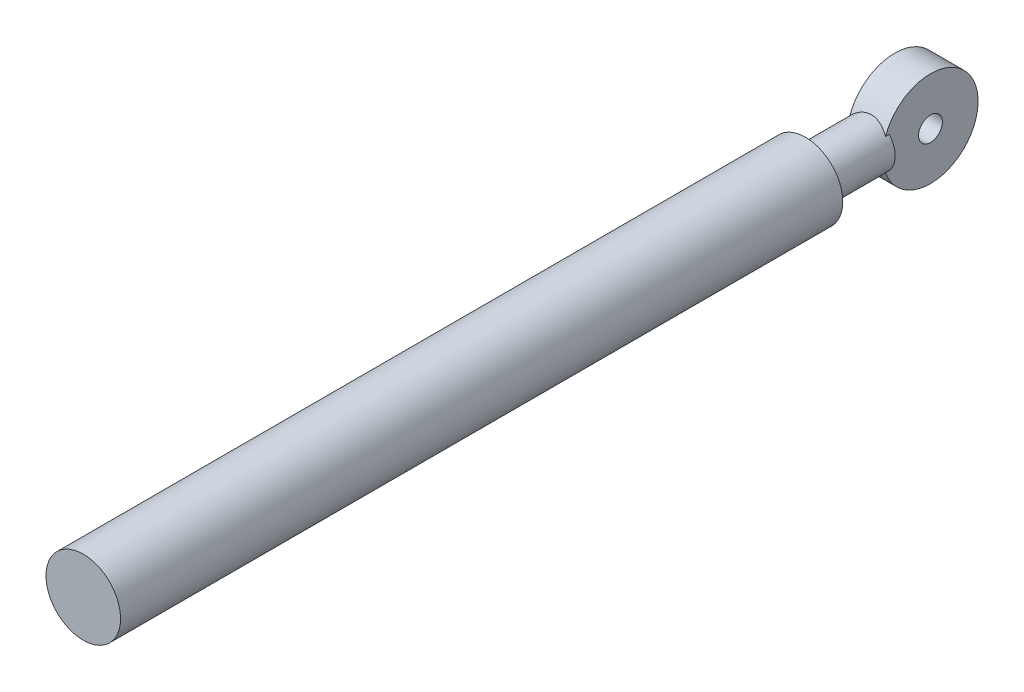
ISO-10303-21;
HEADER;
FILE_DESCRIPTION(('STEP AP214'),'2;1');
FILE_NAME('part.step','',(''),(''),'','','');
FILE_SCHEMA(('AUTOMOTIVE_DESIGN { 1 0 10303 214 1 1 1 1 }'));
ENDSEC;
DATA;
#1=APPLICATION_CONTEXT('core data for automotive mechanical design processes');
#2=APPLICATION_PROTOCOL_DEFINITION('international standard','automotive_design',2000,#1);
#3=PRODUCT_CONTEXT('',#1,'mechanical');
#4=PRODUCT('Part','Part','',(#3));
#5=PRODUCT_RELATED_PRODUCT_CATEGORY('part','',(#4));
#6=PRODUCT_DEFINITION_FORMATION('','',#4);
#7=PRODUCT_DEFINITION_CONTEXT('part definition',#1,'design');
#8=PRODUCT_DEFINITION('design','',#6,#7);
#9=PRODUCT_DEFINITION_SHAPE('','',#8);
#10=(LENGTH_UNIT() NAMED_UNIT(*) SI_UNIT(.MILLI.,.METRE.));
#11=(NAMED_UNIT(*) PLANE_ANGLE_UNIT() SI_UNIT($,.RADIAN.));
#12=(NAMED_UNIT(*) SI_UNIT($,.STERADIAN.) SOLID_ANGLE_UNIT());
#13=UNCERTAINTY_MEASURE_WITH_UNIT(LENGTH_MEASURE(1.E-05),#10,'distance_accuracy_value','');
#14=(GEOMETRIC_REPRESENTATION_CONTEXT(3) GLOBAL_UNCERTAINTY_ASSIGNED_CONTEXT((#13)) GLOBAL_UNIT_ASSIGNED_CONTEXT((#10,
#11,#12)) REPRESENTATION_CONTEXT('',''));
#15=CARTESIAN_POINT('',(0.,0.,0.));
#16=DIRECTION('',(0.,0.,1.));
#17=DIRECTION('',(1.,0.,0.));
#18=AXIS2_PLACEMENT_3D('',#15,#16,#17);
#19=CARTESIAN_POINT('',(2.25,0.,0.));
#20=DIRECTION('',(-1.,0.,0.));
#21=DIRECTION('',(0.,0.,1.));
#22=AXIS2_PLACEMENT_3D('',#19,#20,#21);
#23=CYLINDRICAL_SURFACE('',#22,6.);
#24=CARTESIAN_POINT('',(2.25,1.98431348329844,5.66237582645306));
#25=CARTESIAN_POINT('',(2.13813666082812,2.11115030276206,5.61797685875006));
#26=CARTESIAN_POINT('',(2.01576042330965,2.22829091794649,5.57208492355505));
#27=CARTESIAN_POINT('',(1.7518991291312,2.4412639381615,5.48211140569146));
#28=CARTESIAN_POINT('',(1.61031025079418,2.53697251441184,5.4380414854258));
#29=CARTESIAN_POINT('',(1.31091321285401,2.70387221953945,5.35702900068316));
#30=CARTESIAN_POINT('',(1.15306805921838,2.77500574844847,5.32010326889698));
#31=CARTESIAN_POINT('',(0.825601526936564,2.88934481033804,5.25889159992873));
#32=CARTESIAN_POINT('',(0.65601467059872,2.93262866085224,5.23457025514984));
#33=CARTESIAN_POINT('',(0.324642703557533,2.98670582599646,5.20389150674515));
#34=CARTESIAN_POINT('',(0.163372950606509,2.99989096310939,5.1962143383203));
#35=CARTESIAN_POINT('',(-0.159220391880633,3.00010759988014,5.19609133676106));
#36=CARTESIAN_POINT('',(-0.320543981913064,2.98713885137638,5.20364564815083));
#37=CARTESIAN_POINT('',(-0.623610975659747,2.93812611147972,5.23145148178749));
#38=CARTESIAN_POINT('',(-0.765822940975145,2.90422799392213,5.25051894963233));
#39=CARTESIAN_POINT('',(-1.04247229136283,2.81679187752139,5.29793741206528));
#40=CARTESIAN_POINT('',(-1.17690477173088,2.76324164153951,5.32629418981174));
#41=CARTESIAN_POINT('',(-1.44505950073328,2.63355545510261,5.39166300105566));
#42=CARTESIAN_POINT('',(-1.577992596534,2.55604108746533,5.42916033767801));
#43=CARTESIAN_POINT('',(-1.82968118784106,2.38235535403617,5.50757778142113));
#44=CARTESIAN_POINT('',(-1.94845189493594,2.28620430252958,5.54849413438045));
#45=CARTESIAN_POINT('',(-2.12577521481118,2.11883432839666,5.61383439032238));
#46=CARTESIAN_POINT('',(-2.18943766564424,2.05298796258889,5.63832075886335));
#47=CARTESIAN_POINT('',(-2.25,1.98431348329844,5.66237582645306));
#48=B_SPLINE_CURVE_WITH_KNOTS('',3,(#24,#25,#26,#27,#28,#29,#30,#31,#32,#33,#34,#35,#36,#37,#38,
#39,#40,#41,#42,#43,#44,#45,#46,#47),.UNSPECIFIED.,.F.,.F.,(4,2,2,2,2,2,2,2,2,2,2,4),(0.,
0.524109137853357,1.05117249748309,1.57946295879477,2.10626121767093,2.589474834543,
3.07269303641706,3.51310566325875,3.95379299638219,4.42710067391629,4.89989531067904,
5.18392506929778),.UNSPECIFIED.);
#49=CARTESIAN_POINT('',(2.25,1.98431348329844,5.66237582645306));
#50=VERTEX_POINT('',#49);
#51=CARTESIAN_POINT('',(-2.25,1.98431348329844,5.66237582645306));
#52=VERTEX_POINT('',#51);
#53=EDGE_CURVE('E92',#50,#52,#48,.T.);
#54=ORIENTED_EDGE('',*,*,#53,.F.);
#55=CARTESIAN_POINT('',(2.25,0.,0.));
#56=DIRECTION('',(1.,0.,0.));
#57=DIRECTION('',(0.,0.,-1.));
#58=AXIS2_PLACEMENT_3D('',#55,#56,#57);
#59=CIRCLE('',#58,6.);
#60=CARTESIAN_POINT('',(2.25,-1.98431348329845,5.66237582645306));
#61=VERTEX_POINT('',#60);
#62=EDGE_CURVE('E93',#61,#50,#59,.T.);
#63=ORIENTED_EDGE('',*,*,#62,.F.);
#64=CARTESIAN_POINT('',(-2.25,-1.98431348329845,5.66237582645306));
#65=CARTESIAN_POINT('',(-2.13813666082812,-2.11115030276206,5.61797685875006));
#66=CARTESIAN_POINT('',(-2.01576042330965,-2.2282909179465,5.57208492355505));
#67=CARTESIAN_POINT('',(-1.7518991291312,-2.4412639381615,5.48211140569146));
#68=CARTESIAN_POINT('',(-1.61031025079418,-2.53697251441184,5.4380414854258));
#69=CARTESIAN_POINT('',(-1.31091321285401,-2.70387221953945,5.35702900068316));
#70=CARTESIAN_POINT('',(-1.15306805921838,-2.77500574844847,5.32010326889698));
#71=CARTESIAN_POINT('',(-0.825601526936564,-2.88934481033804,5.25889159992873));
#72=CARTESIAN_POINT('',(-0.65601467059872,-2.93262866085224,5.23457025514983));
#73=CARTESIAN_POINT('',(-0.324642703557533,-2.98670582599647,5.20389150674515));
#74=CARTESIAN_POINT('',(-0.163372950606509,-2.99989096310939,5.19621433832029));
#75=CARTESIAN_POINT('',(0.159220391880633,-3.00010759988014,5.19609133676106));
#76=CARTESIAN_POINT('',(0.320543981913065,-2.98713885137638,5.20364564815083));
#77=CARTESIAN_POINT('',(0.623610975659747,-2.93812611147972,5.23145148178749));
#78=CARTESIAN_POINT('',(0.765822940975145,-2.90422799392213,5.25051894963233));
#79=CARTESIAN_POINT('',(1.04247229136283,-2.81679187752139,5.29793741206528));
#80=CARTESIAN_POINT('',(1.17690477173088,-2.76324164153951,5.32629418981174));
#81=CARTESIAN_POINT('',(1.44505950073328,-2.63355545510261,5.39166300105566));
#82=CARTESIAN_POINT('',(1.577992596534,-2.55604108746533,5.42916033767801));
#83=CARTESIAN_POINT('',(1.82968118784106,-2.38235535403617,5.50757778142113));
#84=CARTESIAN_POINT('',(1.94845189493594,-2.28620430252958,5.54849413438045));
#85=CARTESIAN_POINT('',(2.12577521481118,-2.11883432839666,5.61383439032238));
#86=CARTESIAN_POINT('',(2.18943766564424,-2.0529879625889,5.63832075886335));
#87=CARTESIAN_POINT('',(2.25,-1.98431348329845,5.66237582645306));
#88=B_SPLINE_CURVE_WITH_KNOTS('',3,(#64,#65,#66,#67,#68,#69,#70,#71,#72,#73,#74,#75,#76,#77,#78,
#79,#80,#81,#82,#83,#84,#85,#86,#87),.UNSPECIFIED.,.F.,.F.,(4,2,2,2,2,2,2,2,2,2,2,4),(0.,
0.524109137853358,1.05117249748309,1.57946295879477,2.10626121767093,2.589474834543,
3.07269303641706,3.51310566325875,3.95379299638219,4.42710067391629,4.89989531067904,
5.18392506929778),.UNSPECIFIED.);
#89=CARTESIAN_POINT('',(-2.25,-1.98431348329845,5.66237582645306));
#90=VERTEX_POINT('',#89);
#91=EDGE_CURVE('E124',#90,#61,#88,.T.);
#92=ORIENTED_EDGE('',*,*,#91,.F.);
#93=CARTESIAN_POINT('',(-2.25,0.,0.));
#94=DIRECTION('',(1.,0.,0.));
#95=DIRECTION('',(0.,0.,-1.));
#96=AXIS2_PLACEMENT_3D('',#93,#94,#95);
#97=CIRCLE('',#96,6.);
#98=EDGE_CURVE('E137',#90,#52,#97,.T.);
#99=ORIENTED_EDGE('',*,*,#98,.T.);
#100=EDGE_LOOP('',(#54,#63,#92,#99));
#101=FACE_BOUND('',#100,.T.);
#102=ADVANCED_FACE('F39',(#101),#23,.T.);
#103=CARTESIAN_POINT('',(2.25,0.,0.));
#104=DIRECTION('',(1.,0.,0.));
#105=DIRECTION('',(0.,0.,-1.));
#106=AXIS2_PLACEMENT_3D('',#103,#104,#105);
#107=PLANE('',#106);
#108=CARTESIAN_POINT('',(2.25,0.,0.));
#109=DIRECTION('',(1.,0.,0.));
#110=DIRECTION('',(0.,0.,-1.));
#111=AXIS2_PLACEMENT_3D('',#108,#109,#110);
#112=CIRCLE('',#111,1.5);
#113=CARTESIAN_POINT('',(2.25,0.,-1.5));
#114=VERTEX_POINT('',#113);
#115=EDGE_CURVE('E134',#114,#114,#112,.T.);
#116=ORIENTED_EDGE('',*,*,#115,.F.);
#117=EDGE_LOOP('',(#116));
#118=FACE_BOUND('',#117,.T.);
#119=CARTESIAN_POINT('',(2.25,0.,0.));
#120=DIRECTION('',(1.,0.,0.));
#121=DIRECTION('',(0.,0.,-1.));
#122=AXIS2_PLACEMENT_3D('',#119,#120,#121);
#123=CIRCLE('',#122,5.56214886532175);
#124=CARTESIAN_POINT('',(2.25,1.98431348329844,5.19615242270663));
#125=VERTEX_POINT('',#124);
#126=CARTESIAN_POINT('',(2.25,-1.98431348329844,5.19615242270663));
#127=VERTEX_POINT('',#126);
#128=EDGE_CURVE('E54',#125,#127,#123,.T.);
#129=ORIENTED_EDGE('',*,*,#128,.T.);
#130=DIRECTION('',(0.,0.,-1.));
#131=VECTOR('',#130,1.);
#132=CARTESIAN_POINT('',(2.25,-1.98431348329845,13.5));
#133=LINE('',#132,#131);
#134=EDGE_CURVE('E130',#127,#61,#133,.F.);
#135=ORIENTED_EDGE('',*,*,#134,.T.);
#136=ORIENTED_EDGE('',*,*,#62,.T.);
#137=DIRECTION('',(0.,0.,-1.));
#138=VECTOR('',#137,1.);
#139=CARTESIAN_POINT('',(2.25,1.98431348329844,13.5));
#140=LINE('',#139,#138);
#141=EDGE_CURVE('E59',#50,#125,#140,.T.);
#142=ORIENTED_EDGE('',*,*,#141,.T.);
#143=EDGE_LOOP('',(#129,#135,#136,#142));
#144=FACE_BOUND('',#143,.T.);
#145=ADVANCED_FACE('F144',(#118,#144),#107,.T.);
#146=CARTESIAN_POINT('',(-2.25,0.,0.));
#147=DIRECTION('',(1.,0.,0.));
#148=DIRECTION('',(0.,0.,-1.));
#149=AXIS2_PLACEMENT_3D('',#146,#147,#148);
#150=PLANE('',#149);
#151=CARTESIAN_POINT('',(-2.25,0.,0.));
#152=DIRECTION('',(1.,0.,0.));
#153=DIRECTION('',(0.,0.,-1.));
#154=AXIS2_PLACEMENT_3D('',#151,#152,#153);
#155=CIRCLE('',#154,1.5);
#156=CARTESIAN_POINT('',(-2.25,0.,-1.5));
#157=VERTEX_POINT('',#156);
#158=EDGE_CURVE('E133',#157,#157,#155,.T.);
#159=ORIENTED_EDGE('',*,*,#158,.T.);
#160=EDGE_LOOP('',(#159));
#161=FACE_BOUND('',#160,.T.);
#162=DIRECTION('',(0.,0.,-1.));
#163=VECTOR('',#162,1.);
#164=CARTESIAN_POINT('',(-2.25,-1.98431348329845,13.5));
#165=LINE('',#164,#163);
#166=CARTESIAN_POINT('',(-2.25,-1.98431348329844,5.19615242270663));
#167=VERTEX_POINT('',#166);
#168=EDGE_CURVE('E11',#167,#90,#165,.F.);
#169=ORIENTED_EDGE('',*,*,#168,.F.);
#170=CARTESIAN_POINT('',(-2.25,0.,0.));
#171=DIRECTION('',(1.,0.,0.));
#172=DIRECTION('',(0.,0.,-1.));
#173=AXIS2_PLACEMENT_3D('',#170,#171,#172);
#174=CIRCLE('',#173,5.56214886532175);
#175=CARTESIAN_POINT('',(-2.25,1.98431348329844,5.19615242270663));
#176=VERTEX_POINT('',#175);
#177=EDGE_CURVE('E47',#176,#167,#174,.T.);
#178=ORIENTED_EDGE('',*,*,#177,.F.);
#179=DIRECTION('',(0.,0.,-1.));
#180=VECTOR('',#179,1.);
#181=CARTESIAN_POINT('',(-2.25,1.98431348329844,13.5));
#182=LINE('',#181,#180);
#183=EDGE_CURVE('E83',#52,#176,#182,.T.);
#184=ORIENTED_EDGE('',*,*,#183,.F.);
#185=ORIENTED_EDGE('',*,*,#98,.F.);
#186=EDGE_LOOP('',(#169,#178,#184,#185));
#187=FACE_BOUND('',#186,.T.);
#188=ADVANCED_FACE('F81',(#161,#187),#150,.F.);
#189=CARTESIAN_POINT('',(2.25,0.,0.));
#190=DIRECTION('',(-1.,0.,0.));
#191=DIRECTION('',(0.,0.,1.));
#192=AXIS2_PLACEMENT_3D('',#189,#190,#191);
#193=CYLINDRICAL_SURFACE('',#192,1.5);
#194=ORIENTED_EDGE('',*,*,#115,.T.);
#195=EDGE_LOOP('',(#194));
#196=FACE_BOUND('',#195,.T.);
#197=ORIENTED_EDGE('',*,*,#158,.F.);
#198=EDGE_LOOP('',(#197));
#199=FACE_BOUND('',#198,.T.);
#200=ADVANCED_FACE('F41',(#196,#199),#193,.F.);
#201=CARTESIAN_POINT('',(0.,0.,0.));
#202=DIRECTION('',(0.,0.,-1.));
#203=DIRECTION('',(0.,1.,0.));
#204=AXIS2_PLACEMENT_3D('',#201,#202,#203);
#205=SPHERICAL_SURFACE('',#204,6.);
#206=CARTESIAN_POINT('',(0.,0.,5.19615242270663));
#207=DIRECTION('',(0.,0.,-1.));
#208=DIRECTION('',(0.,1.,0.));
#209=AXIS2_PLACEMENT_3D('',#206,#207,#208);
#210=CIRCLE('',#209,3.);
#211=EDGE_CURVE('E91',#167,#176,#210,.T.);
#212=ORIENTED_EDGE('',*,*,#211,.T.);
#213=ORIENTED_EDGE('',*,*,#177,.T.);
#214=EDGE_LOOP('',(#212,#213));
#215=FACE_BOUND('',#214,.T.);
#216=ADVANCED_FACE('F95',(#215),#205,.F.);
#217=CARTESIAN_POINT('',(0.,0.,13.5));
#218=DIRECTION('',(0.,0.,-1.));
#219=DIRECTION('',(0.,1.,0.));
#220=AXIS2_PLACEMENT_3D('',#217,#218,#219);
#221=CYLINDRICAL_SURFACE('',#220,3.);
#222=ORIENTED_EDGE('',*,*,#134,.F.);
#223=EDGE_CURVE('E96',#125,#127,#210,.T.);
#224=ORIENTED_EDGE('',*,*,#223,.F.);
#225=ORIENTED_EDGE('',*,*,#141,.F.);
#226=ORIENTED_EDGE('',*,*,#53,.T.);
#227=ORIENTED_EDGE('',*,*,#183,.T.);
#228=ORIENTED_EDGE('',*,*,#211,.F.);
#229=ORIENTED_EDGE('',*,*,#168,.T.);
#230=ORIENTED_EDGE('',*,*,#91,.T.);
#231=EDGE_LOOP('',(#222,#224,#225,#226,#227,#228,#229,#230));
#232=FACE_BOUND('',#231,.T.);
#233=CARTESIAN_POINT('',(0.,0.,13.5));
#234=DIRECTION('',(0.,0.,-1.));
#235=DIRECTION('',(0.,1.,0.));
#236=AXIS2_PLACEMENT_3D('',#233,#234,#235);
#237=CIRCLE('',#236,3.);
#238=CARTESIAN_POINT('',(0.,3.,13.5));
#239=VERTEX_POINT('',#238);
#240=EDGE_CURVE('E97',#239,#239,#237,.T.);
#241=ORIENTED_EDGE('',*,*,#240,.T.);
#242=EDGE_LOOP('',(#241));
#243=FACE_BOUND('',#242,.T.);
#244=ADVANCED_FACE('F89',(#232,#243),#221,.T.);
#245=CARTESIAN_POINT('',(0.,0.,104.5));
#246=DIRECTION('',(0.,0.,-1.));
#247=DIRECTION('',(0.,1.,0.));
#248=AXIS2_PLACEMENT_3D('',#245,#246,#247);
#249=PLANE('',#248);
#250=CARTESIAN_POINT('',(0.,0.,104.5));
#251=DIRECTION('',(0.,0.,-1.));
#252=DIRECTION('',(0.,1.,0.));
#253=AXIS2_PLACEMENT_3D('',#250,#251,#252);
#254=CIRCLE('',#253,4.7);
#255=CARTESIAN_POINT('',(0.,4.69999999999999,104.5));
#256=VERTEX_POINT('',#255);
#257=EDGE_CURVE('E237',#256,#256,#254,.T.);
#258=ORIENTED_EDGE('',*,*,#257,.F.);
#259=EDGE_LOOP('',(#258));
#260=FACE_BOUND('',#259,.T.);
#261=ADVANCED_FACE('F118',(#260),#249,.F.);
#262=ORIENTED_EDGE('',*,*,#128,.F.);
#263=ORIENTED_EDGE('',*,*,#223,.T.);
#264=EDGE_LOOP('',(#262,#263));
#265=FACE_BOUND('',#264,.T.);
#266=ADVANCED_FACE('F121',(#265),#205,.F.);
#267=CARTESIAN_POINT('',(0.,0.,13.5));
#268=DIRECTION('',(0.,0.,1.));
#269=DIRECTION('',(0.,-1.,0.));
#270=AXIS2_PLACEMENT_3D('',#267,#268,#269);
#271=PLANE('',#270);
#272=ORIENTED_EDGE('',*,*,#240,.F.);
#273=EDGE_LOOP('',(#272));
#274=FACE_BOUND('',#273,.T.);
#275=CARTESIAN_POINT('',(0.,0.,13.5));
#276=DIRECTION('',(0.,0.,-1.));
#277=DIRECTION('',(0.,1.,0.));
#278=AXIS2_PLACEMENT_3D('',#275,#276,#277);
#279=CIRCLE('',#278,4.7);
#280=CARTESIAN_POINT('',(0.,4.7,13.5));
#281=VERTEX_POINT('',#280);
#282=EDGE_CURVE('E101',#281,#281,#279,.T.);
#283=ORIENTED_EDGE('',*,*,#282,.T.);
#284=EDGE_LOOP('',(#283));
#285=FACE_BOUND('',#284,.T.);
#286=ADVANCED_FACE('F119',(#274,#285),#271,.F.);
#287=CARTESIAN_POINT('',(0.,0.,13.5));
#288=DIRECTION('',(0.,0.,-1.));
#289=DIRECTION('',(0.,1.,0.));
#290=AXIS2_PLACEMENT_3D('',#287,#288,#289);
#291=CYLINDRICAL_SURFACE('',#290,4.7);
#292=ORIENTED_EDGE('',*,*,#257,.T.);
#293=EDGE_LOOP('',(#292));
#294=FACE_BOUND('',#293,.T.);
#295=ORIENTED_EDGE('',*,*,#282,.F.);
#296=EDGE_LOOP('',(#295));
#297=FACE_BOUND('',#296,.T.);
#298=ADVANCED_FACE('F151',(#294,#297),#291,.T.);
#299=CLOSED_SHELL('',(#102,#145,#188,#200,#216,#244,#261,#266,#286,#298));
#300=MANIFOLD_SOLID_BREP('B2',#299);
#301=ADVANCED_BREP_SHAPE_REPRESENTATION('',(#18,#300),#14);
#302=SHAPE_DEFINITION_REPRESENTATION(#9,#301);
ENDSEC;
END-ISO-10303-21;
